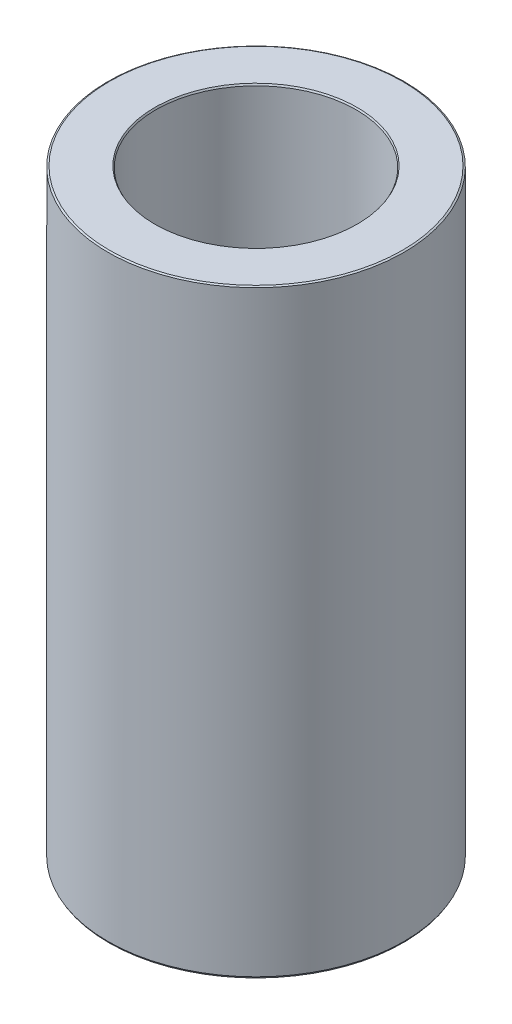
ISO-10303-21;
HEADER;
FILE_DESCRIPTION(('STEP AP214'),'2;1');
FILE_NAME('part.step','',(''),(''),'','','');
FILE_SCHEMA(('AUTOMOTIVE_DESIGN { 1 0 10303 214 1 1 1 1 }'));
ENDSEC;
DATA;
#1=APPLICATION_CONTEXT('core data for automotive mechanical design processes');
#2=APPLICATION_PROTOCOL_DEFINITION('international standard','automotive_design',2000,#1);
#3=PRODUCT_CONTEXT('',#1,'mechanical');
#4=PRODUCT('Part','Part','',(#3));
#5=PRODUCT_RELATED_PRODUCT_CATEGORY('part','',(#4));
#6=PRODUCT_DEFINITION_FORMATION('','',#4);
#7=PRODUCT_DEFINITION_CONTEXT('part definition',#1,'design');
#8=PRODUCT_DEFINITION('design','',#6,#7);
#9=PRODUCT_DEFINITION_SHAPE('','',#8);
#10=(LENGTH_UNIT() NAMED_UNIT(*) SI_UNIT(.MILLI.,.METRE.));
#11=(NAMED_UNIT(*) PLANE_ANGLE_UNIT() SI_UNIT($,.RADIAN.));
#12=(NAMED_UNIT(*) SI_UNIT($,.STERADIAN.) SOLID_ANGLE_UNIT());
#13=UNCERTAINTY_MEASURE_WITH_UNIT(LENGTH_MEASURE(1.E-05),#10,'distance_accuracy_value','');
#14=(GEOMETRIC_REPRESENTATION_CONTEXT(3) GLOBAL_UNCERTAINTY_ASSIGNED_CONTEXT((#13)) GLOBAL_UNIT_ASSIGNED_CONTEXT((#10,
#11,#12)) REPRESENTATION_CONTEXT('',''));
#15=CARTESIAN_POINT('',(0.,0.,0.));
#16=DIRECTION('',(0.,0.,1.));
#17=DIRECTION('',(1.,0.,0.));
#18=AXIS2_PLACEMENT_3D('',#15,#16,#17);
#19=CARTESIAN_POINT('',(0.,161.945501474747,0.));
#20=DIRECTION('',(0.,-1.,0.));
#21=DIRECTION('',(0.,0.,-1.));
#22=AXIS2_PLACEMENT_3D('',#19,#20,#21);
#23=CYLINDRICAL_SURFACE('',#22,40.);
#24=CARTESIAN_POINT('',(0.,0.443442958359686,0.));
#25=DIRECTION('',(0.,1.,0.));
#26=DIRECTION('',(0.,0.,1.));
#27=AXIS2_PLACEMENT_3D('',#24,#25,#26);
#28=CIRCLE('',#27,40.);
#29=CARTESIAN_POINT('',(0.,0.443442958359658,-40.));
#30=VERTEX_POINT('',#29);
#31=EDGE_CURVE('E10',#30,#30,#28,.T.);
#32=CARTESIAN_POINT('',(0.,161.699138486157,0.));
#33=DIRECTION('',(0.,1.,0.));
#34=DIRECTION('',(0.,0.,1.));
#35=AXIS2_PLACEMENT_3D('',#32,#33,#34);
#36=CIRCLE('',#35,40.);
#37=CARTESIAN_POINT('',(0.,161.699138486157,-40.));
#38=VERTEX_POINT('',#37);
#39=EDGE_CURVE('E50',#38,#38,#36,.F.);
#40=CARTESIAN_POINT('',(0.,0.443442958359658,-40.));
#41=CARTESIAN_POINT('',(0.,2.12318978677421,-40.));
#42=CARTESIAN_POINT('',(0.,3.80293661518876,-40.));
#43=CARTESIAN_POINT('',(0.,7.16243027201787,-40.));
#44=CARTESIAN_POINT('',(0.,8.84217710043243,-40.));
#45=CARTESIAN_POINT('',(0.,12.2016707572615,-40.));
#46=CARTESIAN_POINT('',(0.,13.8814175856761,-40.));
#47=CARTESIAN_POINT('',(0.,17.2409112425052,-40.));
#48=CARTESIAN_POINT('',(0.,18.9206580709198,-40.));
#49=CARTESIAN_POINT('',(0.,22.2801517277489,-40.));
#50=CARTESIAN_POINT('',(0.,23.9598985561634,-40.));
#51=CARTESIAN_POINT('',(0.,27.3193922129925,-40.));
#52=CARTESIAN_POINT('',(0.,28.9991390414071,-40.));
#53=CARTESIAN_POINT('',(0.,32.3586326982362,-40.));
#54=CARTESIAN_POINT('',(0.,34.0383795266507,-40.));
#55=CARTESIAN_POINT('',(0.,37.3978731834798,-40.));
#56=CARTESIAN_POINT('',(0.,39.0776200118944,-40.));
#57=CARTESIAN_POINT('',(0.,42.4371136687235,-40.));
#58=CARTESIAN_POINT('',(0.,44.1168604971381,-40.));
#59=CARTESIAN_POINT('',(0.,47.4763541539672,-40.));
#60=CARTESIAN_POINT('',(0.,49.1561009823817,-40.));
#61=CARTESIAN_POINT('',(0.,52.5155946392108,-40.));
#62=CARTESIAN_POINT('',(0.,54.1953414676254,-40.));
#63=CARTESIAN_POINT('',(0.,57.5548351244545,-40.));
#64=CARTESIAN_POINT('',(0.,59.234581952869,-40.));
#65=CARTESIAN_POINT('',(0.,62.5940756096982,-40.));
#66=CARTESIAN_POINT('',(0.,64.2738224381127,-40.));
#67=CARTESIAN_POINT('',(0.,67.6333160949418,-40.));
#68=CARTESIAN_POINT('',(0.,69.3130629233564,-40.));
#69=CARTESIAN_POINT('',(0.,72.6725565801855,-40.));
#70=CARTESIAN_POINT('',(0.,74.3523034086,-40.));
#71=CARTESIAN_POINT('',(0.,77.7117970654291,-40.));
#72=CARTESIAN_POINT('',(0.,79.3915438938437,-40.));
#73=CARTESIAN_POINT('',(0.,82.7510375506728,-40.));
#74=CARTESIAN_POINT('',(0.,84.4307843790874,-40.));
#75=CARTESIAN_POINT('',(0.,87.7902780359165,-40.));
#76=CARTESIAN_POINT('',(0.,89.470024864331,-40.));
#77=CARTESIAN_POINT('',(0.,92.8295185211601,-40.));
#78=CARTESIAN_POINT('',(0.,94.5092653495747,-40.));
#79=CARTESIAN_POINT('',(0.,97.8687590064038,-40.));
#80=CARTESIAN_POINT('',(0.,99.5485058348183,-40.));
#81=CARTESIAN_POINT('',(0.,102.907999491647,-40.));
#82=CARTESIAN_POINT('',(0.,104.587746320062,-40.));
#83=CARTESIAN_POINT('',(0.,107.947239976891,-40.));
#84=CARTESIAN_POINT('',(0.,109.626986805306,-40.));
#85=CARTESIAN_POINT('',(0.,112.986480462135,-40.));
#86=CARTESIAN_POINT('',(0.,114.666227290549,-40.));
#87=CARTESIAN_POINT('',(0.,118.025720947378,-40.));
#88=CARTESIAN_POINT('',(0.,119.705467775793,-40.));
#89=CARTESIAN_POINT('',(0.,123.064961432622,-40.));
#90=CARTESIAN_POINT('',(0.,124.744708261037,-40.));
#91=CARTESIAN_POINT('',(0.,128.104201917866,-40.));
#92=CARTESIAN_POINT('',(0.,129.78394874628,-40.));
#93=CARTESIAN_POINT('',(0.,133.143442403109,-40.));
#94=CARTESIAN_POINT('',(0.,134.823189231524,-40.));
#95=CARTESIAN_POINT('',(0.,138.182682888353,-40.));
#96=CARTESIAN_POINT('',(0.,139.862429716768,-40.));
#97=CARTESIAN_POINT('',(0.,143.221923373597,-40.));
#98=CARTESIAN_POINT('',(0.,144.901670202011,-40.));
#99=CARTESIAN_POINT('',(0.,148.26116385884,-40.));
#100=CARTESIAN_POINT('',(0.,149.940910687255,-40.));
#101=CARTESIAN_POINT('',(0.,153.300404344084,-40.));
#102=CARTESIAN_POINT('',(0.,154.980151172499,-40.));
#103=CARTESIAN_POINT('',(0.,158.339644829328,-40.));
#104=CARTESIAN_POINT('',(0.,160.019391657742,-40.));
#105=CARTESIAN_POINT('',(0.,161.699138486157,-40.));
#106=B_SPLINE_CURVE_WITH_KNOTS('',3,(#40,#41,#42,#43,#44,#45,#46,#47,#48,#49,#50,#51,#52,#53,
#54,#55,#56,#57,#58,#59,#60,#61,#62,#63,#64,#65,#66,#67,#68,#69,#70,#71,#72,#73,#74,#75,#76,#77,
#78,#79,#80,#81,#82,#83,#84,#85,#86,#87,#88,#89,#90,#91,#92,#93,#94,#95,#96,#97,#98,#99,#100,
#101,#102,#103,#104,#105),.UNSPECIFIED.,.F.,.F.,(4,2,2,2,2,2,2,2,2,2,2,2,2,2,2,2,2,2,2,2,2,2,2,
2,2,2,2,2,2,2,2,2,4),(0.,5.03924048524365,10.0784809704873,15.117721455731,20.1569619409747,
25.1962024262183,30.235442911462,35.2746833967056,40.3139238819493,45.353164367193,
50.3924048524366,55.4316453376803,60.4708858229239,65.5101263081676,70.5493667934113,
75.5886072786549,80.6278477638986,85.6670882491423,90.7063287343859,95.7455692196296,
100.784809704873,105.824050190117,110.863290675361,115.902531160604,120.941771645848,
125.981012131092,131.020252616335,136.059493101579,141.098733586823,146.137974072066,
151.17721455731,156.216455042554,161.255695527797),.UNSPECIFIED.);
#107=EDGE_CURVE('BSEAM39',#30,#38,#106,.T.);
#108=ORIENTED_EDGE('',*,*,#31,.T.);
#109=ORIENTED_EDGE('',*,*,#39,.T.);
#110=ORIENTED_EDGE('',*,*,#107,.T.);
#111=ORIENTED_EDGE('',*,*,#107,.F.);
#112=EDGE_LOOP('',(#108,#110,#109,#111));
#113=FACE_BOUND('',#112,.T.);
#114=ADVANCED_FACE('F39',(#113),#23,.T.);
#115=CARTESIAN_POINT('',(0.,161.945501474747,0.));
#116=DIRECTION('',(0.,1.,0.));
#117=DIRECTION('',(0.,0.,1.));
#118=AXIS2_PLACEMENT_3D('',#115,#116,#117);
#119=PLANE('',#118);
#120=CARTESIAN_POINT('',(0.,161.945501474747,0.));
#121=DIRECTION('',(0.,1.,0.));
#122=DIRECTION('',(0.,0.,1.));
#123=AXIS2_PLACEMENT_3D('',#120,#121,#122);
#124=CIRCLE('',#123,27.3469900091544);
#125=CARTESIAN_POINT('',(0.,161.945501474747,27.3469900091544));
#126=VERTEX_POINT('',#125);
#127=EDGE_CURVE('E58',#126,#126,#124,.F.);
#128=ORIENTED_EDGE('',*,*,#127,.T.);
#129=EDGE_LOOP('',(#128));
#130=FACE_BOUND('',#129,.T.);
#131=CARTESIAN_POINT('',(0.,161.945501474747,0.));
#132=DIRECTION('',(0.,1.,0.));
#133=DIRECTION('',(0.,0.,1.));
#134=AXIS2_PLACEMENT_3D('',#131,#132,#133);
#135=CIRCLE('',#134,39.5565570416409);
#136=CARTESIAN_POINT('',(0.,161.945501474747,39.5565570416409));
#137=VERTEX_POINT('',#136);
#138=EDGE_CURVE('E61',#137,#137,#135,.T.);
#139=ORIENTED_EDGE('',*,*,#138,.T.);
#140=EDGE_LOOP('',(#139));
#141=FACE_BOUND('',#140,.T.);
#142=ADVANCED_FACE('F88',(#130,#141),#119,.T.);
#143=CARTESIAN_POINT('',(0.,0.,0.));
#144=DIRECTION('',(0.,1.,0.));
#145=DIRECTION('',(0.,0.,1.));
#146=AXIS2_PLACEMENT_3D('',#143,#144,#145);
#147=PLANE('',#146);
#148=CARTESIAN_POINT('',(0.,0.,0.));
#149=DIRECTION('',(0.,1.,0.));
#150=DIRECTION('',(0.,0.,1.));
#151=AXIS2_PLACEMENT_3D('',#148,#149,#150);
#152=CIRCLE('',#151,27.544069978923);
#153=CARTESIAN_POINT('',(0.,0.,27.544069978923));
#154=VERTEX_POINT('',#153);
#155=EDGE_CURVE('E51',#154,#154,#152,.T.);
#156=ORIENTED_EDGE('',*,*,#155,.T.);
#157=EDGE_LOOP('',(#156));
#158=FACE_BOUND('',#157,.T.);
#159=CARTESIAN_POINT('',(0.,0.,0.));
#160=DIRECTION('',(0.,1.,0.));
#161=DIRECTION('',(0.,0.,1.));
#162=AXIS2_PLACEMENT_3D('',#159,#160,#161);
#163=CIRCLE('',#162,39.7536370114092);
#164=CARTESIAN_POINT('',(0.,0.,39.7536370114092));
#165=VERTEX_POINT('',#164);
#166=EDGE_CURVE('E54',#165,#165,#163,.F.);
#167=ORIENTED_EDGE('',*,*,#166,.T.);
#168=EDGE_LOOP('',(#167));
#169=FACE_BOUND('',#168,.T.);
#170=ADVANCED_FACE('F83',(#158,#169),#147,.F.);
#171=CARTESIAN_POINT('',(0.,161.945501474747,0.));
#172=DIRECTION('',(0.,-1.,0.));
#173=DIRECTION('',(0.,0.,-1.));
#174=AXIS2_PLACEMENT_3D('',#171,#172,#173);
#175=CYLINDRICAL_SURFACE('',#174,27.1006270205638);
#176=CARTESIAN_POINT('',(0.,161.502058516388,0.));
#177=DIRECTION('',(0.,1.,0.));
#178=DIRECTION('',(0.,0.,1.));
#179=AXIS2_PLACEMENT_3D('',#176,#177,#178);
#180=CIRCLE('',#179,27.1006270205638);
#181=CARTESIAN_POINT('',(0.,161.502058516388,-27.1006270205638));
#182=VERTEX_POINT('',#181);
#183=EDGE_CURVE('E67',#182,#182,#180,.T.);
#184=CARTESIAN_POINT('',(0.,0.246362988590543,0.));
#185=DIRECTION('',(0.,1.,0.));
#186=DIRECTION('',(0.,0.,1.));
#187=AXIS2_PLACEMENT_3D('',#184,#185,#186);
#188=CIRCLE('',#187,27.1006270205638);
#189=CARTESIAN_POINT('',(0.,0.246362988590515,-27.1006270205638));
#190=VERTEX_POINT('',#189);
#191=EDGE_CURVE('E69',#190,#190,#188,.F.);
#192=CARTESIAN_POINT('',(0.,161.502058516388,-27.1006270205638));
#193=CARTESIAN_POINT('',(0.,159.822311687974,-27.1006270205638));
#194=CARTESIAN_POINT('',(0.,158.142564859559,-27.1006270205638));
#195=CARTESIAN_POINT('',(0.,154.78307120273,-27.1006270205638));
#196=CARTESIAN_POINT('',(0.,153.103324374315,-27.1006270205638));
#197=CARTESIAN_POINT('',(0.,149.743830717486,-27.1006270205638));
#198=CARTESIAN_POINT('',(0.,148.064083889072,-27.1006270205638));
#199=CARTESIAN_POINT('',(0.,144.704590232243,-27.1006270205638));
#200=CARTESIAN_POINT('',(0.,143.024843403828,-27.1006270205638));
#201=CARTESIAN_POINT('',(0.,139.665349746999,-27.1006270205638));
#202=CARTESIAN_POINT('',(0.,137.985602918584,-27.1006270205638));
#203=CARTESIAN_POINT('',(0.,134.626109261755,-27.1006270205638));
#204=CARTESIAN_POINT('',(0.,132.946362433341,-27.1006270205638));
#205=CARTESIAN_POINT('',(0.,129.586868776511,-27.1006270205638));
#206=CARTESIAN_POINT('',(0.,127.907121948097,-27.1006270205638));
#207=CARTESIAN_POINT('',(0.,124.547628291268,-27.1006270205638));
#208=CARTESIAN_POINT('',(0.,122.867881462853,-27.1006270205638));
#209=CARTESIAN_POINT('',(0.,119.508387806024,-27.1006270205638));
#210=CARTESIAN_POINT('',(0.,117.82864097761,-27.1006270205638));
#211=CARTESIAN_POINT('',(0.,114.46914732078,-27.1006270205638));
#212=CARTESIAN_POINT('',(0.,112.789400492366,-27.1006270205638));
#213=CARTESIAN_POINT('',(0.,109.429906835537,-27.1006270205638));
#214=CARTESIAN_POINT('',(0.,107.750160007122,-27.1006270205638));
#215=CARTESIAN_POINT('',(0.,104.390666350293,-27.1006270205638));
#216=CARTESIAN_POINT('',(0.,102.710919521879,-27.1006270205638));
#217=CARTESIAN_POINT('',(0.,99.3514258650494,-27.1006270205638));
#218=CARTESIAN_POINT('',(0.,97.6716790366349,-27.1006270205638));
#219=CARTESIAN_POINT('',(0.,94.3121853798058,-27.1006270205638));
#220=CARTESIAN_POINT('',(0.,92.6324385513912,-27.1006270205638));
#221=CARTESIAN_POINT('',(0.,89.2729448945621,-27.1006270205638));
#222=CARTESIAN_POINT('',(0.,87.5931980661475,-27.1006270205638));
#223=CARTESIAN_POINT('',(0.,84.2337044093184,-27.1006270205638));
#224=CARTESIAN_POINT('',(0.,82.5539575809039,-27.1006270205638));
#225=CARTESIAN_POINT('',(0.,79.1944639240748,-27.1006270205638));
#226=CARTESIAN_POINT('',(0.,77.5147170956602,-27.1006270205638));
#227=CARTESIAN_POINT('',(0.,74.1552234388311,-27.1006270205638));
#228=CARTESIAN_POINT('',(0.,72.4754766104165,-27.1006270205638));
#229=CARTESIAN_POINT('',(0.,69.1159829535874,-27.1006270205638));
#230=CARTESIAN_POINT('',(0.,67.4362361251728,-27.1006270205638));
#231=CARTESIAN_POINT('',(0.,64.0767424683437,-27.1006270205638));
#232=CARTESIAN_POINT('',(0.,62.3969956399292,-27.1006270205638));
#233=CARTESIAN_POINT('',(0.,59.0375019831001,-27.1006270205638));
#234=CARTESIAN_POINT('',(0.,57.3577551546855,-27.1006270205638));
#235=CARTESIAN_POINT('',(0.,53.9982614978564,-27.1006270205638));
#236=CARTESIAN_POINT('',(0.,52.3185146694418,-27.1006270205638));
#237=CARTESIAN_POINT('',(0.,48.9590210126127,-27.1006270205638));
#238=CARTESIAN_POINT('',(0.,47.2792741841981,-27.1006270205638));
#239=CARTESIAN_POINT('',(0.,43.919780527369,-27.1006270205638));
#240=CARTESIAN_POINT('',(0.,42.2400336989545,-27.1006270205638));
#241=CARTESIAN_POINT('',(0.,38.8805400421254,-27.1006270205638));
#242=CARTESIAN_POINT('',(0.,37.2007932137108,-27.1006270205638));
#243=CARTESIAN_POINT('',(0.,33.8412995568817,-27.1006270205638));
#244=CARTESIAN_POINT('',(0.,32.1615527284671,-27.1006270205638));
#245=CARTESIAN_POINT('',(0.,28.802059071638,-27.1006270205638));
#246=CARTESIAN_POINT('',(0.,27.1223122432234,-27.1006270205638));
#247=CARTESIAN_POINT('',(0.,23.7628185863943,-27.1006270205638));
#248=CARTESIAN_POINT('',(0.,22.0830717579798,-27.1006270205638));
#249=CARTESIAN_POINT('',(0.,18.7235781011507,-27.1006270205638));
#250=CARTESIAN_POINT('',(0.,17.0438312727361,-27.1006270205638));
#251=CARTESIAN_POINT('',(0.,13.684337615907,-27.1006270205638));
#252=CARTESIAN_POINT('',(0.,12.0045907874924,-27.1006270205638));
#253=CARTESIAN_POINT('',(0.,8.64509713066331,-27.1006270205638));
#254=CARTESIAN_POINT('',(0.,6.96535030224875,-27.1006270205638));
#255=CARTESIAN_POINT('',(0.,3.60585664541963,-27.1006270205638));
#256=CARTESIAN_POINT('',(0.,1.92610981700507,-27.1006270205638));
#257=CARTESIAN_POINT('',(0.,0.246362988590515,-27.1006270205638));
#258=B_SPLINE_CURVE_WITH_KNOTS('',3,(#192,#193,#194,#195,#196,#197,#198,#199,#200,#201,#202,
#203,#204,#205,#206,#207,#208,#209,#210,#211,#212,#213,#214,#215,#216,#217,#218,#219,#220,#221,
#222,#223,#224,#225,#226,#227,#228,#229,#230,#231,#232,#233,#234,#235,#236,#237,#238,#239,#240,
#241,#242,#243,#244,#245,#246,#247,#248,#249,#250,#251,#252,#253,#254,#255,#256,#257),
.UNSPECIFIED.,.F.,.F.,(4,2,2,2,2,2,2,2,2,2,2,2,2,2,2,2,2,2,2,2,2,2,2,2,2,2,2,2,2,2,2,2,4),(0.,
5.03924048524365,10.0784809704873,15.117721455731,20.1569619409747,25.1962024262184,
30.235442911462,35.2746833967057,40.3139238819494,45.3531643671931,50.3924048524367,
55.4316453376804,60.4708858229241,65.5101263081677,70.5493667934114,75.5886072786551,
80.6278477638988,85.6670882491425,90.7063287343861,95.7455692196298,100.784809704873,
105.824050190117,110.863290675361,115.902531160604,120.941771645848,125.981012131092,
131.020252616336,136.059493101579,141.098733586823,146.137974072067,151.17721455731,
156.216455042554,161.255695527798),.UNSPECIFIED.);
#259=EDGE_CURVE('BSEAM71',#182,#190,#258,.T.);
#260=ORIENTED_EDGE('',*,*,#183,.T.);
#261=ORIENTED_EDGE('',*,*,#191,.T.);
#262=ORIENTED_EDGE('',*,*,#259,.T.);
#263=ORIENTED_EDGE('',*,*,#259,.F.);
#264=EDGE_LOOP('',(#260,#262,#261,#263));
#265=FACE_BOUND('',#264,.T.);
#266=ADVANCED_FACE('F71',(#265),#175,.F.);
#267=CARTESIAN_POINT('',(0.,161.502058516388,0.));
#268=DIRECTION('',(0.,1.,0.));
#269=DIRECTION('',(0.,0.,1.));
#270=AXIS2_PLACEMENT_3D('',#267,#268,#269);
#271=CONICAL_SURFACE('',#270,27.1006270205638,0.507108480938107);
#272=ORIENTED_EDGE('',*,*,#127,.F.);
#273=EDGE_LOOP('',(#272));
#274=FACE_BOUND('',#273,.T.);
#275=ORIENTED_EDGE('',*,*,#183,.F.);
#276=EDGE_LOOP('',(#275));
#277=FACE_BOUND('',#276,.T.);
#278=ADVANCED_FACE('F77',(#274,#277),#271,.F.);
#279=CARTESIAN_POINT('',(0.,0.,0.));
#280=DIRECTION('',(0.,-1.,0.));
#281=DIRECTION('',(0.,0.,-1.));
#282=AXIS2_PLACEMENT_3D('',#279,#280,#281);
#283=CONICAL_SURFACE('',#282,27.544069978923,1.06368784585676);
#284=ORIENTED_EDGE('',*,*,#191,.F.);
#285=EDGE_LOOP('',(#284));
#286=FACE_BOUND('',#285,.T.);
#287=ORIENTED_EDGE('',*,*,#155,.F.);
#288=EDGE_LOOP('',(#287));
#289=FACE_BOUND('',#288,.T.);
#290=ADVANCED_FACE('F73',(#286,#289),#283,.F.);
#291=CARTESIAN_POINT('',(0.,0.443442958359686,0.));
#292=DIRECTION('',(0.,1.,0.));
#293=DIRECTION('',(0.,0.,1.));
#294=AXIS2_PLACEMENT_3D('',#291,#292,#293);
#295=CONICAL_SURFACE('',#294,40.,0.507108480938131);
#296=ORIENTED_EDGE('',*,*,#166,.F.);
#297=EDGE_LOOP('',(#296));
#298=FACE_BOUND('',#297,.T.);
#299=ORIENTED_EDGE('',*,*,#31,.F.);
#300=EDGE_LOOP('',(#299));
#301=FACE_BOUND('',#300,.T.);
#302=ADVANCED_FACE('F76',(#298,#301),#295,.T.);
#303=CARTESIAN_POINT('',(0.,161.945501474747,0.));
#304=DIRECTION('',(0.,-1.,0.));
#305=DIRECTION('',(0.,0.,-1.));
#306=AXIS2_PLACEMENT_3D('',#303,#304,#305);
#307=CONICAL_SURFACE('',#306,39.5565570416409,1.06368784585679);
#308=ORIENTED_EDGE('',*,*,#39,.F.);
#309=EDGE_LOOP('',(#308));
#310=FACE_BOUND('',#309,.T.);
#311=ORIENTED_EDGE('',*,*,#138,.F.);
#312=EDGE_LOOP('',(#311));
#313=FACE_BOUND('',#312,.T.);
#314=ADVANCED_FACE('F45',(#310,#313),#307,.T.);
#315=CLOSED_SHELL('',(#114,#142,#170,#266,#278,#290,#302,#314));
#316=MANIFOLD_SOLID_BREP('B2',#315);
#317=ADVANCED_BREP_SHAPE_REPRESENTATION('',(#18,#316),#14);
#318=SHAPE_DEFINITION_REPRESENTATION(#9,#317);
ENDSEC;
END-ISO-10303-21;
